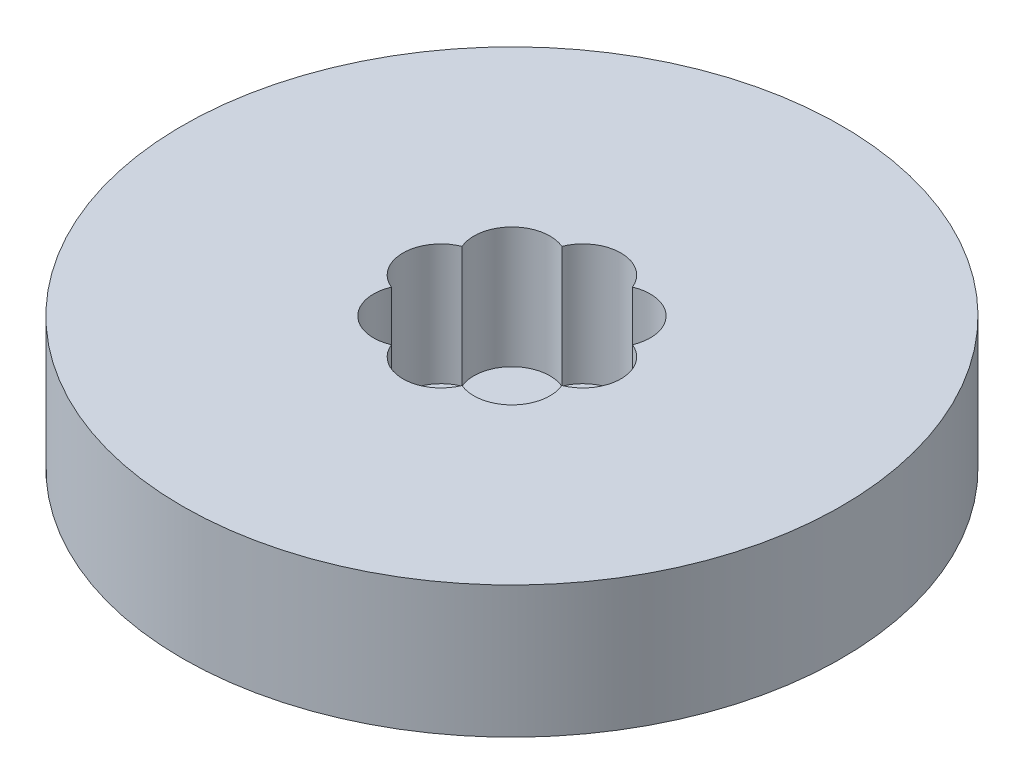
ISO-10303-21;
HEADER;
FILE_DESCRIPTION(('STEP AP214'),'2;1');
FILE_NAME('part.step','',(''),(''),'','','');
FILE_SCHEMA(('AUTOMOTIVE_DESIGN { 1 0 10303 214 1 1 1 1 }'));
ENDSEC;
DATA;
#1=APPLICATION_CONTEXT('core data for automotive mechanical design processes');
#2=APPLICATION_PROTOCOL_DEFINITION('international standard','automotive_design',2000,#1);
#3=PRODUCT_CONTEXT('',#1,'mechanical');
#4=PRODUCT('Part','Part','',(#3));
#5=PRODUCT_RELATED_PRODUCT_CATEGORY('part','',(#4));
#6=PRODUCT_DEFINITION_FORMATION('','',#4);
#7=PRODUCT_DEFINITION_CONTEXT('part definition',#1,'design');
#8=PRODUCT_DEFINITION('design','',#6,#7);
#9=PRODUCT_DEFINITION_SHAPE('','',#8);
#10=(LENGTH_UNIT() NAMED_UNIT(*) SI_UNIT(.MILLI.,.METRE.));
#11=(NAMED_UNIT(*) PLANE_ANGLE_UNIT() SI_UNIT($,.RADIAN.));
#12=(NAMED_UNIT(*) SI_UNIT($,.STERADIAN.) SOLID_ANGLE_UNIT());
#13=UNCERTAINTY_MEASURE_WITH_UNIT(LENGTH_MEASURE(1.E-05),#10,'distance_accuracy_value','');
#14=(GEOMETRIC_REPRESENTATION_CONTEXT(3) GLOBAL_UNCERTAINTY_ASSIGNED_CONTEXT((#13)) GLOBAL_UNIT_ASSIGNED_CONTEXT((#10,
#11,#12)) REPRESENTATION_CONTEXT('',''));
#15=CARTESIAN_POINT('',(0.,0.,0.));
#16=DIRECTION('',(0.,0.,1.));
#17=DIRECTION('',(1.,0.,0.));
#18=AXIS2_PLACEMENT_3D('',#15,#16,#17);
#19=CARTESIAN_POINT('',(0.,11.,0.));
#20=DIRECTION('',(0.,-1.,0.));
#21=DIRECTION('',(0.,0.,-1.));
#22=AXIS2_PLACEMENT_3D('',#19,#20,#21);
#23=CYLINDRICAL_SURFACE('',#22,5.);
#24=CARTESIAN_POINT('',(0.,0.,0.));
#25=DIRECTION('',(0.,1.,0.));
#26=DIRECTION('',(0.,0.,1.));
#27=AXIS2_PLACEMENT_3D('',#24,#25,#26);
#28=CIRCLE('',#27,5.);
#29=CARTESIAN_POINT('',(0.,0.,5.));
#30=VERTEX_POINT('',#29);
#31=EDGE_CURVE('E166',#30,#30,#28,.T.);
#32=ORIENTED_EDGE('',*,*,#31,.F.);
#33=EDGE_LOOP('',(#32));
#34=FACE_BOUND('',#33,.T.);
#35=CARTESIAN_POINT('',(0.,0.897185374508783,0.));
#36=DIRECTION('',(0.,1.,0.));
#37=DIRECTION('',(0.,0.,1.));
#38=AXIS2_PLACEMENT_3D('',#35,#36,#37);
#39=CIRCLE('',#38,5.);
#40=CARTESIAN_POINT('',(0.,0.897185374508783,5.));
#41=VERTEX_POINT('',#40);
#42=EDGE_CURVE('E11',#41,#41,#39,.T.);
#43=ORIENTED_EDGE('',*,*,#42,.T.);
#44=EDGE_LOOP('',(#43));
#45=FACE_BOUND('',#44,.T.);
#46=ADVANCED_FACE('F39',(#34,#45),#23,.F.);
#47=CARTESIAN_POINT('',(0.,11.,0.));
#48=DIRECTION('',(0.,-1.,0.));
#49=DIRECTION('',(0.,0.,-1.));
#50=AXIS2_PLACEMENT_3D('',#47,#48,#49);
#51=CYLINDRICAL_SURFACE('',#50,27.5);
#52=CARTESIAN_POINT('',(0.,11.,0.));
#53=DIRECTION('',(0.,1.,0.));
#54=DIRECTION('',(0.,0.,1.));
#55=AXIS2_PLACEMENT_3D('',#52,#53,#54);
#56=CIRCLE('',#55,27.5);
#57=CARTESIAN_POINT('',(0.,11.,27.5));
#58=VERTEX_POINT('',#57);
#59=EDGE_CURVE('E50',#58,#58,#56,.T.);
#60=ORIENTED_EDGE('',*,*,#59,.F.);
#61=EDGE_LOOP('',(#60));
#62=FACE_BOUND('',#61,.T.);
#63=CARTESIAN_POINT('',(0.,0.,0.));
#64=DIRECTION('',(0.,1.,0.));
#65=DIRECTION('',(0.,0.,1.));
#66=AXIS2_PLACEMENT_3D('',#63,#64,#65);
#67=CIRCLE('',#66,27.5);
#68=CARTESIAN_POINT('',(0.,0.,27.5));
#69=VERTEX_POINT('',#68);
#70=EDGE_CURVE('E173',#69,#69,#67,.T.);
#71=ORIENTED_EDGE('',*,*,#70,.T.);
#72=EDGE_LOOP('',(#71));
#73=FACE_BOUND('',#72,.T.);
#74=ADVANCED_FACE('F41',(#62,#73),#51,.T.);
#75=CARTESIAN_POINT('',(0.,11.,0.));
#76=DIRECTION('',(0.,1.,0.));
#77=DIRECTION('',(0.,0.,1.));
#78=AXIS2_PLACEMENT_3D('',#75,#76,#77);
#79=PLANE('',#78);
#80=CARTESIAN_POINT('',(-4.1867517899366,11.,4.18675178993661));
#81=DIRECTION('',(0.,1.,0.));
#82=DIRECTION('',(0.707106781186549,0.,0.707106781186546));
#83=AXIS2_PLACEMENT_3D('',#80,#81,#82);
#84=CIRCLE('',#83,3.1767115287081);
#85=CARTESIAN_POINT('',(-7.11089515068279,11.,2.94542921202589));
#86=VERTEX_POINT('',#85);
#87=CARTESIAN_POINT('',(-2.94542921202587,11.,7.1108951506828));
#88=VERTEX_POINT('',#87);
#89=EDGE_CURVE('E159',#86,#88,#84,.T.);
#90=ORIENTED_EDGE('',*,*,#89,.F.);
#91=CARTESIAN_POINT('',(-5.92096116361818,11.,0.));
#92=DIRECTION('',(0.,1.,0.));
#93=DIRECTION('',(0.,0.,1.));
#94=AXIS2_PLACEMENT_3D('',#91,#92,#93);
#95=CIRCLE('',#94,3.1767115287081);
#96=CARTESIAN_POINT('',(-7.11089515068286,11.,-2.94542921202586));
#97=VERTEX_POINT('',#96);
#98=EDGE_CURVE('E167',#97,#86,#95,.T.);
#99=ORIENTED_EDGE('',*,*,#98,.F.);
#100=CARTESIAN_POINT('',(-4.18675178993666,11.,-4.18675178993656));
#101=DIRECTION('',(0.,1.,0.));
#102=DIRECTION('',(-0.707106781186539,0.,0.707106781186556));
#103=AXIS2_PLACEMENT_3D('',#100,#101,#102);
#104=CIRCLE('',#103,3.1767115287081);
#105=CARTESIAN_POINT('',(-2.94542921202597,11.,-7.11089515068276));
#106=VERTEX_POINT('',#105);
#107=EDGE_CURVE('E53',#106,#97,#104,.T.);
#108=ORIENTED_EDGE('',*,*,#107,.F.);
#109=CARTESIAN_POINT('',(0.,11.,-5.92096116361818));
#110=DIRECTION('',(0.,1.,0.));
#111=DIRECTION('',(-1.,0.,0.));
#112=AXIS2_PLACEMENT_3D('',#109,#110,#111);
#113=CIRCLE('',#112,3.1767115287081);
#114=CARTESIAN_POINT('',(2.94542921202582,11.,-7.11089515068282));
#115=VERTEX_POINT('',#114);
#116=EDGE_CURVE('E117',#115,#106,#113,.T.);
#117=ORIENTED_EDGE('',*,*,#116,.F.);
#118=CARTESIAN_POINT('',(4.18675178993657,11.,-4.18675178993664));
#119=DIRECTION('',(0.,1.,0.));
#120=DIRECTION('',(-0.707106781186554,0.,-0.707106781186541));
#121=AXIS2_PLACEMENT_3D('',#118,#119,#120);
#122=CIRCLE('',#121,3.1767115287081);
#123=CARTESIAN_POINT('',(7.11089515068275,11.,-2.94542921202591));
#124=VERTEX_POINT('',#123);
#125=EDGE_CURVE('E120',#124,#115,#122,.T.);
#126=ORIENTED_EDGE('',*,*,#125,.F.);
#127=CARTESIAN_POINT('',(5.92096116361818,11.,0.));
#128=DIRECTION('',(0.,1.,0.));
#129=DIRECTION('',(0.,0.,-1.));
#130=AXIS2_PLACEMENT_3D('',#127,#128,#129);
#131=CIRCLE('',#130,3.1767115287081);
#132=CARTESIAN_POINT('',(7.11089515068282,11.,2.94542921202588));
#133=VERTEX_POINT('',#132);
#134=EDGE_CURVE('E136',#133,#124,#131,.T.);
#135=ORIENTED_EDGE('',*,*,#134,.F.);
#136=CARTESIAN_POINT('',(4.18675178993663,11.,4.18675178993659));
#137=DIRECTION('',(0.,1.,0.));
#138=DIRECTION('',(0.707106781186544,0.,-0.707106781186551));
#139=AXIS2_PLACEMENT_3D('',#136,#137,#138);
#140=CIRCLE('',#139,3.1767115287081);
#141=CARTESIAN_POINT('',(2.94542921202592,11.,7.11089515068278));
#142=VERTEX_POINT('',#141);
#143=EDGE_CURVE('E138',#142,#133,#140,.T.);
#144=ORIENTED_EDGE('',*,*,#143,.F.);
#145=CARTESIAN_POINT('',(0.,11.,5.92096116361818));
#146=DIRECTION('',(0.,1.,0.));
#147=DIRECTION('',(1.,0.,0.));
#148=AXIS2_PLACEMENT_3D('',#145,#146,#147);
#149=CIRCLE('',#148,3.1767115287081);
#150=EDGE_CURVE('E146',#88,#142,#149,.T.);
#151=ORIENTED_EDGE('',*,*,#150,.F.);
#152=EDGE_LOOP('',(#90,#99,#108,#117,#126,#135,#144,#151));
#153=FACE_BOUND('',#152,.T.);
#154=ORIENTED_EDGE('',*,*,#59,.T.);
#155=EDGE_LOOP('',(#154));
#156=FACE_BOUND('',#155,.T.);
#157=ADVANCED_FACE('F181',(#153,#156),#79,.T.);
#158=CARTESIAN_POINT('',(0.,0.,0.));
#159=DIRECTION('',(0.,1.,0.));
#160=DIRECTION('',(0.,0.,1.));
#161=AXIS2_PLACEMENT_3D('',#158,#159,#160);
#162=PLANE('',#161);
#163=ORIENTED_EDGE('',*,*,#31,.T.);
#164=EDGE_LOOP('',(#163));
#165=FACE_BOUND('',#164,.T.);
#166=ORIENTED_EDGE('',*,*,#70,.F.);
#167=EDGE_LOOP('',(#166));
#168=FACE_BOUND('',#167,.T.);
#169=ADVANCED_FACE('F179',(#165,#168),#162,.F.);
#170=CARTESIAN_POINT('',(-5.92096116361818,0.897185374508783,0.));
#171=DIRECTION('',(0.,1.,0.));
#172=DIRECTION('',(0.,0.,1.));
#173=AXIS2_PLACEMENT_3D('',#170,#171,#172);
#174=CYLINDRICAL_SURFACE('',#173,3.1767115287081);
#175=ORIENTED_EDGE('',*,*,#98,.T.);
#176=DIRECTION('',(0.,1.,0.));
#177=VECTOR('',#176,1.);
#178=CARTESIAN_POINT('',(-7.11089515068279,5.94859268725439,2.94542921202589));
#179=LINE('',#178,#177);
#180=CARTESIAN_POINT('',(-7.11089515068279,0.897185374508783,2.94542921202589));
#181=VERTEX_POINT('',#180);
#182=EDGE_CURVE('E65',#86,#181,#179,.F.);
#183=ORIENTED_EDGE('',*,*,#182,.T.);
#184=CARTESIAN_POINT('',(-5.92096116361818,0.897185374508783,0.));
#185=DIRECTION('',(0.,1.,0.));
#186=DIRECTION('',(0.,0.,1.));
#187=AXIS2_PLACEMENT_3D('',#184,#185,#186);
#188=CIRCLE('',#187,3.1767115287081);
#189=CARTESIAN_POINT('',(-7.11089515068286,0.897185374508783,-2.94542921202586));
#190=VERTEX_POINT('',#189);
#191=EDGE_CURVE('E170',#190,#181,#188,.T.);
#192=ORIENTED_EDGE('',*,*,#191,.F.);
#193=DIRECTION('',(0.,1.,0.));
#194=VECTOR('',#193,1.);
#195=CARTESIAN_POINT('',(-7.11089515068286,5.94859268725439,-2.94542921202586));
#196=LINE('',#195,#194);
#197=EDGE_CURVE('E124',#190,#97,#196,.T.);
#198=ORIENTED_EDGE('',*,*,#197,.T.);
#199=EDGE_LOOP('',(#175,#183,#192,#198));
#200=FACE_BOUND('',#199,.T.);
#201=ADVANCED_FACE('F185',(#200),#174,.F.);
#202=CARTESIAN_POINT('',(-5.92096116361818,0.897185374508783,0.));
#203=DIRECTION('',(0.,1.,0.));
#204=DIRECTION('',(0.,0.,1.));
#205=AXIS2_PLACEMENT_3D('',#202,#203,#204);
#206=PLANE('',#205);
#207=ORIENTED_EDGE('',*,*,#191,.T.);
#208=CARTESIAN_POINT('',(-4.1867517899366,0.897185374508783,4.18675178993661));
#209=DIRECTION('',(0.,1.,0.));
#210=DIRECTION('',(0.707106781186549,0.,0.707106781186546));
#211=AXIS2_PLACEMENT_3D('',#208,#209,#210);
#212=CIRCLE('',#211,3.1767115287081);
#213=CARTESIAN_POINT('',(-2.94542921202587,0.897185374508783,7.1108951506828));
#214=VERTEX_POINT('',#213);
#215=EDGE_CURVE('E161',#181,#214,#212,.T.);
#216=ORIENTED_EDGE('',*,*,#215,.T.);
#217=CARTESIAN_POINT('',(0.,0.897185374508783,5.92096116361818));
#218=DIRECTION('',(0.,1.,0.));
#219=DIRECTION('',(1.,0.,0.));
#220=AXIS2_PLACEMENT_3D('',#217,#218,#219);
#221=CIRCLE('',#220,3.1767115287081);
#222=CARTESIAN_POINT('',(2.94542921202592,0.897185374508783,7.11089515068278));
#223=VERTEX_POINT('',#222);
#224=EDGE_CURVE('E149',#214,#223,#221,.T.);
#225=ORIENTED_EDGE('',*,*,#224,.T.);
#226=CARTESIAN_POINT('',(4.18675178993663,0.897185374508783,4.18675178993659));
#227=DIRECTION('',(0.,1.,0.));
#228=DIRECTION('',(0.707106781186544,0.,-0.707106781186551));
#229=AXIS2_PLACEMENT_3D('',#226,#227,#228);
#230=CIRCLE('',#229,3.1767115287081);
#231=CARTESIAN_POINT('',(7.11089515068282,0.897185374508783,2.94542921202588));
#232=VERTEX_POINT('',#231);
#233=EDGE_CURVE('E143',#223,#232,#230,.T.);
#234=ORIENTED_EDGE('',*,*,#233,.T.);
#235=CARTESIAN_POINT('',(5.92096116361818,0.897185374508783,0.));
#236=DIRECTION('',(0.,1.,0.));
#237=DIRECTION('',(0.,0.,-1.));
#238=AXIS2_PLACEMENT_3D('',#235,#236,#237);
#239=CIRCLE('',#238,3.1767115287081);
#240=CARTESIAN_POINT('',(7.11089515068275,0.897185374508783,-2.94542921202591));
#241=VERTEX_POINT('',#240);
#242=EDGE_CURVE('E140',#232,#241,#239,.T.);
#243=ORIENTED_EDGE('',*,*,#242,.T.);
#244=CARTESIAN_POINT('',(4.18675178993657,0.897185374508783,-4.18675178993664));
#245=DIRECTION('',(0.,1.,0.));
#246=DIRECTION('',(-0.707106781186554,0.,-0.707106781186541));
#247=AXIS2_PLACEMENT_3D('',#244,#245,#246);
#248=CIRCLE('',#247,3.1767115287081);
#249=CARTESIAN_POINT('',(2.94542921202582,0.897185374508783,-7.11089515068282));
#250=VERTEX_POINT('',#249);
#251=EDGE_CURVE('E111',#241,#250,#248,.T.);
#252=ORIENTED_EDGE('',*,*,#251,.T.);
#253=CARTESIAN_POINT('',(0.,0.897185374508783,-5.92096116361818));
#254=DIRECTION('',(0.,1.,0.));
#255=DIRECTION('',(-1.,0.,0.));
#256=AXIS2_PLACEMENT_3D('',#253,#254,#255);
#257=CIRCLE('',#256,3.1767115287081);
#258=CARTESIAN_POINT('',(-2.94542921202597,0.897185374508783,-7.11089515068276));
#259=VERTEX_POINT('',#258);
#260=EDGE_CURVE('E104',#250,#259,#257,.T.);
#261=ORIENTED_EDGE('',*,*,#260,.T.);
#262=CARTESIAN_POINT('',(-4.18675178993666,0.897185374508783,-4.18675178993656));
#263=DIRECTION('',(0.,1.,0.));
#264=DIRECTION('',(-0.707106781186539,0.,0.707106781186556));
#265=AXIS2_PLACEMENT_3D('',#262,#263,#264);
#266=CIRCLE('',#265,3.1767115287081);
#267=EDGE_CURVE('E112',#259,#190,#266,.T.);
#268=ORIENTED_EDGE('',*,*,#267,.T.);
#269=EDGE_LOOP('',(#207,#216,#225,#234,#243,#252,#261,#268));
#270=FACE_BOUND('',#269,.T.);
#271=ORIENTED_EDGE('',*,*,#42,.F.);
#272=EDGE_LOOP('',(#271));
#273=FACE_BOUND('',#272,.T.);
#274=ADVANCED_FACE('F107',(#270,#273),#206,.T.);
#275=CARTESIAN_POINT('',(-4.1867517899366,0.897185374508783,4.18675178993661));
#276=DIRECTION('',(0.,1.,0.));
#277=DIRECTION('',(0.,0.,1.));
#278=AXIS2_PLACEMENT_3D('',#275,#276,#277);
#279=CYLINDRICAL_SURFACE('',#278,3.1767115287081);
#280=ORIENTED_EDGE('',*,*,#89,.T.);
#281=DIRECTION('',(0.,1.,0.));
#282=VECTOR('',#281,1.);
#283=CARTESIAN_POINT('',(-2.94542921202587,5.94859268725439,7.1108951506828));
#284=LINE('',#283,#282);
#285=EDGE_CURVE('E160',#88,#214,#284,.F.);
#286=ORIENTED_EDGE('',*,*,#285,.T.);
#287=ORIENTED_EDGE('',*,*,#215,.F.);
#288=ORIENTED_EDGE('',*,*,#182,.F.);
#289=EDGE_LOOP('',(#280,#286,#287,#288));
#290=FACE_BOUND('',#289,.T.);
#291=ADVANCED_FACE('F202',(#290),#279,.F.);
#292=CARTESIAN_POINT('',(-4.18675178993666,0.897185374508783,-4.18675178993656));
#293=DIRECTION('',(0.,1.,0.));
#294=DIRECTION('',(0.,0.,1.));
#295=AXIS2_PLACEMENT_3D('',#292,#293,#294);
#296=CYLINDRICAL_SURFACE('',#295,3.1767115287081);
#297=ORIENTED_EDGE('',*,*,#267,.F.);
#298=DIRECTION('',(0.,1.,0.));
#299=VECTOR('',#298,1.);
#300=CARTESIAN_POINT('',(-2.94542921202596,5.94859268725439,-7.11089515068276));
#301=LINE('',#300,#299);
#302=EDGE_CURVE('E119',#106,#259,#301,.F.);
#303=ORIENTED_EDGE('',*,*,#302,.F.);
#304=ORIENTED_EDGE('',*,*,#107,.T.);
#305=ORIENTED_EDGE('',*,*,#197,.F.);
#306=EDGE_LOOP('',(#297,#303,#304,#305));
#307=FACE_BOUND('',#306,.T.);
#308=ADVANCED_FACE('F123',(#307),#296,.F.);
#309=CARTESIAN_POINT('',(0.,0.897185374508783,5.92096116361818));
#310=DIRECTION('',(0.,1.,0.));
#311=DIRECTION('',(0.,0.,1.));
#312=AXIS2_PLACEMENT_3D('',#309,#310,#311);
#313=CYLINDRICAL_SURFACE('',#312,3.1767115287081);
#314=ORIENTED_EDGE('',*,*,#150,.T.);
#315=DIRECTION('',(0.,1.,0.));
#316=VECTOR('',#315,1.);
#317=CARTESIAN_POINT('',(2.94542921202592,5.94859268725439,7.11089515068278));
#318=LINE('',#317,#316);
#319=EDGE_CURVE('E141',#142,#223,#318,.F.);
#320=ORIENTED_EDGE('',*,*,#319,.T.);
#321=ORIENTED_EDGE('',*,*,#224,.F.);
#322=ORIENTED_EDGE('',*,*,#285,.F.);
#323=EDGE_LOOP('',(#314,#320,#321,#322));
#324=FACE_BOUND('',#323,.T.);
#325=ADVANCED_FACE('F208',(#324),#313,.F.);
#326=CARTESIAN_POINT('',(4.18675178993663,0.897185374508783,4.18675178993659));
#327=DIRECTION('',(0.,1.,0.));
#328=DIRECTION('',(0.,0.,1.));
#329=AXIS2_PLACEMENT_3D('',#326,#327,#328);
#330=CYLINDRICAL_SURFACE('',#329,3.1767115287081);
#331=DIRECTION('',(0.,1.,0.));
#332=VECTOR('',#331,1.);
#333=CARTESIAN_POINT('',(7.11089515068282,5.94859268725439,2.94542921202588));
#334=LINE('',#333,#332);
#335=EDGE_CURVE('E151',#133,#232,#334,.F.);
#336=ORIENTED_EDGE('',*,*,#335,.T.);
#337=ORIENTED_EDGE('',*,*,#233,.F.);
#338=ORIENTED_EDGE('',*,*,#319,.F.);
#339=ORIENTED_EDGE('',*,*,#143,.T.);
#340=EDGE_LOOP('',(#336,#337,#338,#339));
#341=FACE_BOUND('',#340,.T.);
#342=ADVANCED_FACE('F211',(#341),#330,.F.);
#343=CARTESIAN_POINT('',(5.92096116361818,0.897185374508783,0.));
#344=DIRECTION('',(0.,1.,0.));
#345=DIRECTION('',(0.,0.,1.));
#346=AXIS2_PLACEMENT_3D('',#343,#344,#345);
#347=CYLINDRICAL_SURFACE('',#346,3.1767115287081);
#348=ORIENTED_EDGE('',*,*,#134,.T.);
#349=DIRECTION('',(0.,1.,0.));
#350=VECTOR('',#349,1.);
#351=CARTESIAN_POINT('',(7.11089515068275,5.94859268725439,-2.94542921202591));
#352=LINE('',#351,#350);
#353=EDGE_CURVE('E131',#124,#241,#352,.F.);
#354=ORIENTED_EDGE('',*,*,#353,.T.);
#355=ORIENTED_EDGE('',*,*,#242,.F.);
#356=ORIENTED_EDGE('',*,*,#335,.F.);
#357=EDGE_LOOP('',(#348,#354,#355,#356));
#358=FACE_BOUND('',#357,.T.);
#359=ADVANCED_FACE('F214',(#358),#347,.F.);
#360=CARTESIAN_POINT('',(4.18675178993657,0.897185374508783,-4.18675178993664));
#361=DIRECTION('',(0.,1.,0.));
#362=DIRECTION('',(0.,0.,1.));
#363=AXIS2_PLACEMENT_3D('',#360,#361,#362);
#364=CYLINDRICAL_SURFACE('',#363,3.1767115287081);
#365=DIRECTION('',(0.,1.,0.));
#366=VECTOR('',#365,1.);
#367=CARTESIAN_POINT('',(2.94542921202582,5.94859268725439,-7.11089515068282));
#368=LINE('',#367,#366);
#369=EDGE_CURVE('E154',#115,#250,#368,.F.);
#370=ORIENTED_EDGE('',*,*,#369,.T.);
#371=ORIENTED_EDGE('',*,*,#251,.F.);
#372=ORIENTED_EDGE('',*,*,#353,.F.);
#373=ORIENTED_EDGE('',*,*,#125,.T.);
#374=EDGE_LOOP('',(#370,#371,#372,#373));
#375=FACE_BOUND('',#374,.T.);
#376=ADVANCED_FACE('F218',(#375),#364,.F.);
#377=CARTESIAN_POINT('',(0.,0.897185374508783,-5.92096116361818));
#378=DIRECTION('',(0.,1.,0.));
#379=DIRECTION('',(0.,0.,1.));
#380=AXIS2_PLACEMENT_3D('',#377,#378,#379);
#381=CYLINDRICAL_SURFACE('',#380,3.1767115287081);
#382=ORIENTED_EDGE('',*,*,#116,.T.);
#383=ORIENTED_EDGE('',*,*,#302,.T.);
#384=ORIENTED_EDGE('',*,*,#260,.F.);
#385=ORIENTED_EDGE('',*,*,#369,.F.);
#386=EDGE_LOOP('',(#382,#383,#384,#385));
#387=FACE_BOUND('',#386,.T.);
#388=ADVANCED_FACE('F121',(#387),#381,.F.);
#389=CLOSED_SHELL('',(#46,#74,#157,#169,#201,#274,#291,#308,#325,#342,#359,#376,#388));
#390=MANIFOLD_SOLID_BREP('B2',#389);
#391=ADVANCED_BREP_SHAPE_REPRESENTATION('',(#18,#390),#14);
#392=SHAPE_DEFINITION_REPRESENTATION(#9,#391);
ENDSEC;
END-ISO-10303-21;
